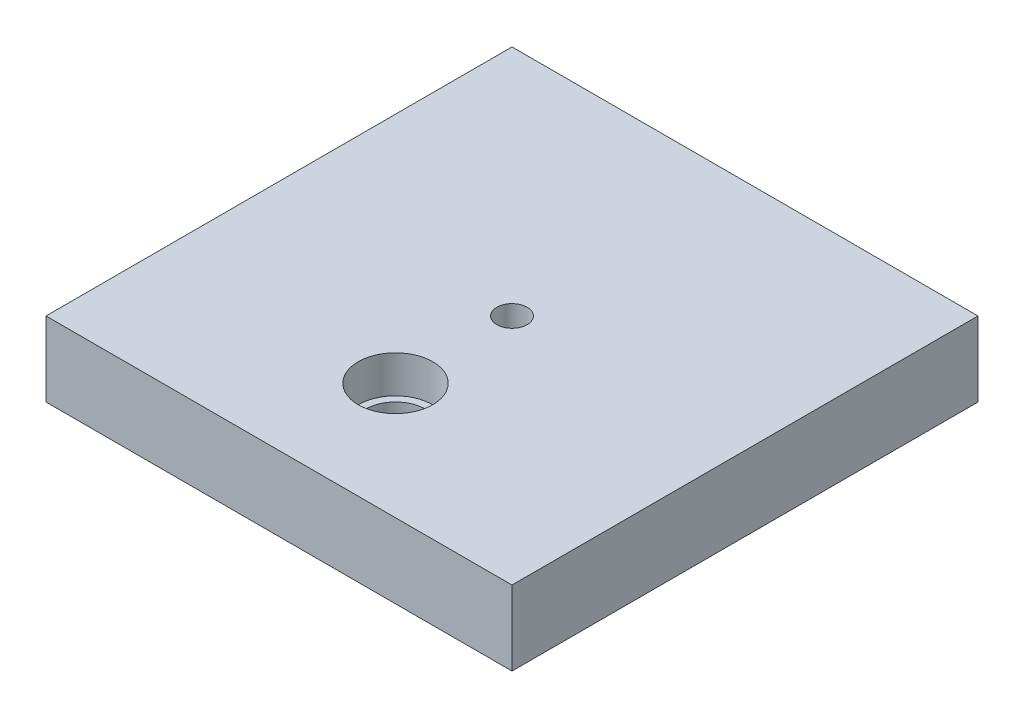
ISO-10303-21;
HEADER;
FILE_DESCRIPTION(('STEP AP214'),'2;1');
FILE_NAME('part.step','',(''),(''),'','','');
FILE_SCHEMA(('AUTOMOTIVE_DESIGN { 1 0 10303 214 1 1 1 1 }'));
ENDSEC;
DATA;
#1=APPLICATION_CONTEXT('core data for automotive mechanical design processes');
#2=APPLICATION_PROTOCOL_DEFINITION('international standard','automotive_design',2000,#1);
#3=PRODUCT_CONTEXT('',#1,'mechanical');
#4=PRODUCT('Part','Part','',(#3));
#5=PRODUCT_RELATED_PRODUCT_CATEGORY('part','',(#4));
#6=PRODUCT_DEFINITION_FORMATION('','',#4);
#7=PRODUCT_DEFINITION_CONTEXT('part definition',#1,'design');
#8=PRODUCT_DEFINITION('design','',#6,#7);
#9=PRODUCT_DEFINITION_SHAPE('','',#8);
#10=(LENGTH_UNIT() NAMED_UNIT(*) SI_UNIT(.MILLI.,.METRE.));
#11=(NAMED_UNIT(*) PLANE_ANGLE_UNIT() SI_UNIT($,.RADIAN.));
#12=(NAMED_UNIT(*) SI_UNIT($,.STERADIAN.) SOLID_ANGLE_UNIT());
#13=UNCERTAINTY_MEASURE_WITH_UNIT(LENGTH_MEASURE(1.E-05),#10,'distance_accuracy_value','');
#14=(GEOMETRIC_REPRESENTATION_CONTEXT(3) GLOBAL_UNCERTAINTY_ASSIGNED_CONTEXT((#13)) GLOBAL_UNIT_ASSIGNED_CONTEXT((#10,
#11,#12)) REPRESENTATION_CONTEXT('',''));
#15=CARTESIAN_POINT('',(0.,0.,0.));
#16=DIRECTION('',(0.,0.,1.));
#17=DIRECTION('',(1.,0.,0.));
#18=AXIS2_PLACEMENT_3D('',#15,#16,#17);
#19=CARTESIAN_POINT('',(0.,16.,0.));
#20=DIRECTION('',(0.,1.,0.));
#21=DIRECTION('',(0.,0.,1.));
#22=AXIS2_PLACEMENT_3D('',#19,#20,#21);
#23=PLANE('',#22);
#24=CARTESIAN_POINT('',(0.,16.,25.));
#25=DIRECTION('',(0.,1.,0.));
#26=DIRECTION('',(0.,0.,1.));
#27=AXIS2_PLACEMENT_3D('',#24,#25,#26);
#28=CIRCLE('',#27,8.);
#29=CARTESIAN_POINT('',(0.,16.,33.));
#30=VERTEX_POINT('',#29);
#31=EDGE_CURVE('E125',#30,#30,#28,.T.);
#32=ORIENTED_EDGE('',*,*,#31,.F.);
#33=EDGE_LOOP('',(#32));
#34=FACE_BOUND('',#33,.T.);
#35=DIRECTION('',(0.,0.,-1.));
#36=VECTOR('',#35,1.);
#37=CARTESIAN_POINT('',(50.,16.,-50.));
#38=LINE('',#37,#36);
#39=CARTESIAN_POINT('',(50.,16.,50.));
#40=VERTEX_POINT('',#39);
#41=CARTESIAN_POINT('',(50.,16.,-50.));
#42=VERTEX_POINT('',#41);
#43=EDGE_CURVE('E91',#40,#42,#38,.T.);
#44=ORIENTED_EDGE('',*,*,#43,.T.);
#45=DIRECTION('',(-1.,0.,0.));
#46=VECTOR('',#45,1.);
#47=CARTESIAN_POINT('',(-50.,16.,-50.));
#48=LINE('',#47,#46);
#49=CARTESIAN_POINT('',(-50.,16.,-50.));
#50=VERTEX_POINT('',#49);
#51=EDGE_CURVE('E86',#42,#50,#48,.T.);
#52=ORIENTED_EDGE('',*,*,#51,.T.);
#53=DIRECTION('',(0.,0.,1.));
#54=VECTOR('',#53,1.);
#55=CARTESIAN_POINT('',(-50.,16.,-50.));
#56=LINE('',#55,#54);
#57=CARTESIAN_POINT('',(-50.,16.,50.));
#58=VERTEX_POINT('',#57);
#59=EDGE_CURVE('E89',#50,#58,#56,.T.);
#60=ORIENTED_EDGE('',*,*,#59,.T.);
#61=DIRECTION('',(1.,0.,0.));
#62=VECTOR('',#61,1.);
#63=CARTESIAN_POINT('',(-50.,16.,50.));
#64=LINE('',#63,#62);
#65=EDGE_CURVE('E56',#58,#40,#64,.T.);
#66=ORIENTED_EDGE('',*,*,#65,.T.);
#67=EDGE_LOOP('',(#44,#52,#60,#66));
#68=FACE_BOUND('',#67,.T.);
#69=CARTESIAN_POINT('',(0.,16.,0.));
#70=DIRECTION('',(0.,1.,0.));
#71=DIRECTION('',(0.,0.,1.));
#72=AXIS2_PLACEMENT_3D('',#69,#70,#71);
#73=CIRCLE('',#72,3.25);
#74=CARTESIAN_POINT('',(0.,16.,3.25000000000002));
#75=VERTEX_POINT('',#74);
#76=EDGE_CURVE('E106',#75,#75,#73,.T.);
#77=ORIENTED_EDGE('',*,*,#76,.F.);
#78=EDGE_LOOP('',(#77));
#79=FACE_BOUND('',#78,.T.);
#80=ADVANCED_FACE('F39',(#34,#68,#79),#23,.T.);
#81=CARTESIAN_POINT('',(0.,0.,0.));
#82=DIRECTION('',(0.,1.,0.));
#83=DIRECTION('',(0.,0.,1.));
#84=AXIS2_PLACEMENT_3D('',#81,#82,#83);
#85=PLANE('',#84);
#86=CARTESIAN_POINT('',(0.,0.,25.));
#87=DIRECTION('',(0.,1.,0.));
#88=DIRECTION('',(0.,0.,1.));
#89=AXIS2_PLACEMENT_3D('',#86,#87,#88);
#90=CIRCLE('',#89,6.4);
#91=CARTESIAN_POINT('',(0.,0.,31.4));
#92=VERTEX_POINT('',#91);
#93=EDGE_CURVE('E128',#92,#92,#90,.F.);
#94=ORIENTED_EDGE('',*,*,#93,.F.);
#95=EDGE_LOOP('',(#94));
#96=FACE_BOUND('',#95,.T.);
#97=DIRECTION('',(0.,0.,-1.));
#98=VECTOR('',#97,1.);
#99=CARTESIAN_POINT('',(50.,0.,-50.));
#100=LINE('',#99,#98);
#101=CARTESIAN_POINT('',(50.,0.,50.));
#102=VERTEX_POINT('',#101);
#103=CARTESIAN_POINT('',(50.,0.,-50.));
#104=VERTEX_POINT('',#103);
#105=EDGE_CURVE('E103',#102,#104,#100,.T.);
#106=ORIENTED_EDGE('',*,*,#105,.F.);
#107=DIRECTION('',(1.,0.,0.));
#108=VECTOR('',#107,1.);
#109=CARTESIAN_POINT('',(-50.,0.,50.));
#110=LINE('',#109,#108);
#111=CARTESIAN_POINT('',(-50.,0.,50.));
#112=VERTEX_POINT('',#111);
#113=EDGE_CURVE('E79',#112,#102,#110,.T.);
#114=ORIENTED_EDGE('',*,*,#113,.F.);
#115=DIRECTION('',(0.,0.,1.));
#116=VECTOR('',#115,1.);
#117=CARTESIAN_POINT('',(-50.,0.,-50.));
#118=LINE('',#117,#116);
#119=CARTESIAN_POINT('',(-50.,0.,-50.));
#120=VERTEX_POINT('',#119);
#121=EDGE_CURVE('E73',#120,#112,#118,.T.);
#122=ORIENTED_EDGE('',*,*,#121,.F.);
#123=DIRECTION('',(-1.,0.,0.));
#124=VECTOR('',#123,1.);
#125=CARTESIAN_POINT('',(-50.,0.,-50.));
#126=LINE('',#125,#124);
#127=EDGE_CURVE('E95',#104,#120,#126,.T.);
#128=ORIENTED_EDGE('',*,*,#127,.F.);
#129=EDGE_LOOP('',(#106,#114,#122,#128));
#130=FACE_BOUND('',#129,.T.);
#131=CARTESIAN_POINT('',(0.,0.,0.));
#132=DIRECTION('',(0.,1.,0.));
#133=DIRECTION('',(0.,0.,1.));
#134=AXIS2_PLACEMENT_3D('',#131,#132,#133);
#135=CIRCLE('',#134,3.25);
#136=CARTESIAN_POINT('',(0.,0.,3.25000000000002));
#137=VERTEX_POINT('',#136);
#138=EDGE_CURVE('E117',#137,#137,#135,.T.);
#139=ORIENTED_EDGE('',*,*,#138,.T.);
#140=EDGE_LOOP('',(#139));
#141=FACE_BOUND('',#140,.T.);
#142=ADVANCED_FACE('F114',(#96,#130,#141),#85,.F.);
#143=CARTESIAN_POINT('',(50.,16.,-50.));
#144=DIRECTION('',(-1.,0.,0.));
#145=DIRECTION('',(0.,0.,1.));
#146=AXIS2_PLACEMENT_3D('',#143,#144,#145);
#147=PLANE('',#146);
#148=ORIENTED_EDGE('',*,*,#105,.T.);
#149=DIRECTION('',(0.,-1.,0.));
#150=VECTOR('',#149,1.);
#151=CARTESIAN_POINT('',(50.,16.,-50.));
#152=LINE('',#151,#150);
#153=EDGE_CURVE('E12',#42,#104,#152,.T.);
#154=ORIENTED_EDGE('',*,*,#153,.F.);
#155=ORIENTED_EDGE('',*,*,#43,.F.);
#156=DIRECTION('',(0.,-1.,0.));
#157=VECTOR('',#156,1.);
#158=CARTESIAN_POINT('',(50.,16.,50.));
#159=LINE('',#158,#157);
#160=EDGE_CURVE('E99',#40,#102,#159,.T.);
#161=ORIENTED_EDGE('',*,*,#160,.T.);
#162=EDGE_LOOP('',(#148,#154,#155,#161));
#163=FACE_BOUND('',#162,.T.);
#164=ADVANCED_FACE('F41',(#163),#147,.F.);
#165=CARTESIAN_POINT('',(-50.,16.,-50.));
#166=DIRECTION('',(0.,0.,1.));
#167=DIRECTION('',(1.,0.,0.));
#168=AXIS2_PLACEMENT_3D('',#165,#166,#167);
#169=PLANE('',#168);
#170=ORIENTED_EDGE('',*,*,#127,.T.);
#171=DIRECTION('',(0.,-1.,0.));
#172=VECTOR('',#171,1.);
#173=CARTESIAN_POINT('',(-50.,16.,-50.));
#174=LINE('',#173,#172);
#175=EDGE_CURVE('E48',#50,#120,#174,.T.);
#176=ORIENTED_EDGE('',*,*,#175,.F.);
#177=ORIENTED_EDGE('',*,*,#51,.F.);
#178=ORIENTED_EDGE('',*,*,#153,.T.);
#179=EDGE_LOOP('',(#170,#176,#177,#178));
#180=FACE_BOUND('',#179,.T.);
#181=ADVANCED_FACE('F94',(#180),#169,.F.);
#182=CARTESIAN_POINT('',(-50.,16.,-50.));
#183=DIRECTION('',(1.,0.,0.));
#184=DIRECTION('',(0.,0.,-1.));
#185=AXIS2_PLACEMENT_3D('',#182,#183,#184);
#186=PLANE('',#185);
#187=ORIENTED_EDGE('',*,*,#121,.T.);
#188=DIRECTION('',(0.,-1.,0.));
#189=VECTOR('',#188,1.);
#190=CARTESIAN_POINT('',(-50.,16.,50.));
#191=LINE('',#190,#189);
#192=EDGE_CURVE('E96',#58,#112,#191,.T.);
#193=ORIENTED_EDGE('',*,*,#192,.F.);
#194=ORIENTED_EDGE('',*,*,#59,.F.);
#195=ORIENTED_EDGE('',*,*,#175,.T.);
#196=EDGE_LOOP('',(#187,#193,#194,#195));
#197=FACE_BOUND('',#196,.T.);
#198=ADVANCED_FACE('F97',(#197),#186,.F.);
#199=CARTESIAN_POINT('',(-50.,16.,50.));
#200=DIRECTION('',(0.,0.,-1.));
#201=DIRECTION('',(-1.,0.,0.));
#202=AXIS2_PLACEMENT_3D('',#199,#200,#201);
#203=PLANE('',#202);
#204=ORIENTED_EDGE('',*,*,#113,.T.);
#205=ORIENTED_EDGE('',*,*,#160,.F.);
#206=ORIENTED_EDGE('',*,*,#65,.F.);
#207=ORIENTED_EDGE('',*,*,#192,.T.);
#208=EDGE_LOOP('',(#204,#205,#206,#207));
#209=FACE_BOUND('',#208,.T.);
#210=ADVANCED_FACE('F111',(#209),#203,.F.);
#211=CARTESIAN_POINT('',(0.,16.,0.));
#212=DIRECTION('',(0.,-1.,0.));
#213=DIRECTION('',(0.,0.,-1.));
#214=AXIS2_PLACEMENT_3D('',#211,#212,#213);
#215=CYLINDRICAL_SURFACE('',#214,3.25);
#216=ORIENTED_EDGE('',*,*,#76,.T.);
#217=EDGE_LOOP('',(#216));
#218=FACE_BOUND('',#217,.T.);
#219=ORIENTED_EDGE('',*,*,#138,.F.);
#220=EDGE_LOOP('',(#219));
#221=FACE_BOUND('',#220,.T.);
#222=ADVANCED_FACE('F151',(#218,#221),#215,.F.);
#223=CARTESIAN_POINT('',(0.,8.,25.));
#224=DIRECTION('',(0.,1.,0.));
#225=DIRECTION('',(0.,0.,1.));
#226=AXIS2_PLACEMENT_3D('',#223,#224,#225);
#227=CYLINDRICAL_SURFACE('',#226,8.);
#228=CARTESIAN_POINT('',(0.,8.,25.));
#229=DIRECTION('',(0.,1.,0.));
#230=DIRECTION('',(0.,0.,1.));
#231=AXIS2_PLACEMENT_3D('',#228,#229,#230);
#232=CIRCLE('',#231,8.);
#233=CARTESIAN_POINT('',(0.,8.,33.));
#234=VERTEX_POINT('',#233);
#235=EDGE_CURVE('E122',#234,#234,#232,.T.);
#236=ORIENTED_EDGE('',*,*,#235,.F.);
#237=EDGE_LOOP('',(#236));
#238=FACE_BOUND('',#237,.T.);
#239=ORIENTED_EDGE('',*,*,#31,.T.);
#240=EDGE_LOOP('',(#239));
#241=FACE_BOUND('',#240,.T.);
#242=ADVANCED_FACE('F145',(#238,#241),#227,.F.);
#243=CARTESIAN_POINT('',(0.,8.,25.));
#244=DIRECTION('',(0.,1.,0.));
#245=DIRECTION('',(0.,0.,1.));
#246=AXIS2_PLACEMENT_3D('',#243,#244,#245);
#247=PLANE('',#246);
#248=CARTESIAN_POINT('',(0.,8.,25.));
#249=DIRECTION('',(0.,1.,0.));
#250=DIRECTION('',(0.,0.,1.));
#251=AXIS2_PLACEMENT_3D('',#248,#249,#250);
#252=CIRCLE('',#251,6.4);
#253=CARTESIAN_POINT('',(0.,8.,31.4));
#254=VERTEX_POINT('',#253);
#255=EDGE_CURVE('E135',#254,#254,#252,.T.);
#256=ORIENTED_EDGE('',*,*,#255,.F.);
#257=EDGE_LOOP('',(#256));
#258=FACE_BOUND('',#257,.T.);
#259=ORIENTED_EDGE('',*,*,#235,.T.);
#260=EDGE_LOOP('',(#259));
#261=FACE_BOUND('',#260,.T.);
#262=ADVANCED_FACE('F142',(#258,#261),#247,.T.);
#263=CARTESIAN_POINT('',(0.,-0.000999999999999265,25.));
#264=DIRECTION('',(0.,1.,0.));
#265=DIRECTION('',(0.,0.,1.));
#266=AXIS2_PLACEMENT_3D('',#263,#264,#265);
#267=CYLINDRICAL_SURFACE('',#266,6.4);
#268=ORIENTED_EDGE('',*,*,#255,.T.);
#269=EDGE_LOOP('',(#268));
#270=FACE_BOUND('',#269,.T.);
#271=ORIENTED_EDGE('',*,*,#93,.T.);
#272=EDGE_LOOP('',(#271));
#273=FACE_BOUND('',#272,.T.);
#274=ADVANCED_FACE('F139',(#270,#273),#267,.F.);
#275=CLOSED_SHELL('',(#80,#142,#164,#181,#198,#210,#222,#242,#262,#274));
#276=MANIFOLD_SOLID_BREP('B2',#275);
#277=ADVANCED_BREP_SHAPE_REPRESENTATION('',(#18,#276),#14);
#278=SHAPE_DEFINITION_REPRESENTATION(#9,#277);
ENDSEC;
END-ISO-10303-21;
